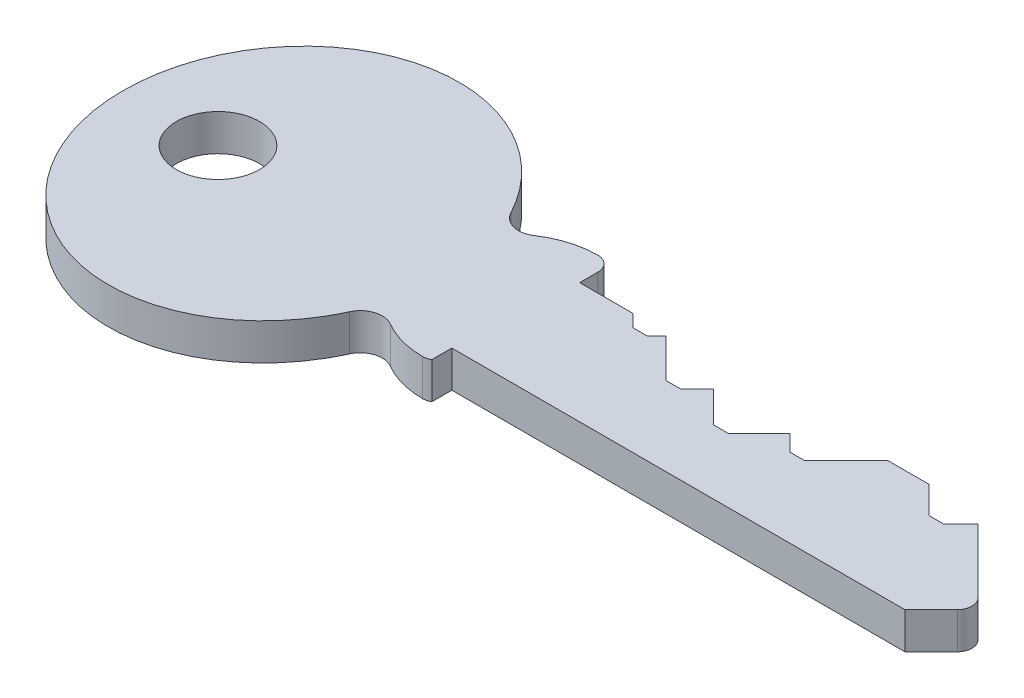
ISO-10303-21;
HEADER;
FILE_DESCRIPTION(('STEP AP214'),'2;1');
FILE_NAME('part.step','',(''),(''),'','','');
FILE_SCHEMA(('AUTOMOTIVE_DESIGN { 1 0 10303 214 1 1 1 1 }'));
ENDSEC;
DATA;
#1=APPLICATION_CONTEXT('core data for automotive mechanical design processes');
#2=APPLICATION_PROTOCOL_DEFINITION('international standard','automotive_design',2000,#1);
#3=PRODUCT_CONTEXT('',#1,'mechanical');
#4=PRODUCT('Part','Part','',(#3));
#5=PRODUCT_RELATED_PRODUCT_CATEGORY('part','',(#4));
#6=PRODUCT_DEFINITION_FORMATION('','',#4);
#7=PRODUCT_DEFINITION_CONTEXT('part definition',#1,'design');
#8=PRODUCT_DEFINITION('design','',#6,#7);
#9=PRODUCT_DEFINITION_SHAPE('','',#8);
#10=(LENGTH_UNIT() NAMED_UNIT(*) SI_UNIT(.MILLI.,.METRE.));
#11=(NAMED_UNIT(*) PLANE_ANGLE_UNIT() SI_UNIT($,.RADIAN.));
#12=(NAMED_UNIT(*) SI_UNIT($,.STERADIAN.) SOLID_ANGLE_UNIT());
#13=UNCERTAINTY_MEASURE_WITH_UNIT(LENGTH_MEASURE(1.E-05),#10,'distance_accuracy_value','');
#14=(GEOMETRIC_REPRESENTATION_CONTEXT(3) GLOBAL_UNCERTAINTY_ASSIGNED_CONTEXT((#13)) GLOBAL_UNIT_ASSIGNED_CONTEXT((#10,
#11,#12)) REPRESENTATION_CONTEXT('',''));
#15=CARTESIAN_POINT('',(0.,0.,0.));
#16=DIRECTION('',(0.,0.,1.));
#17=DIRECTION('',(1.,0.,0.));
#18=AXIS2_PLACEMENT_3D('',#15,#16,#17);
#19=CARTESIAN_POINT('',(-16.,1.25,0.));
#20=DIRECTION('',(0.,1.,0.));
#21=DIRECTION('',(0.,0.,1.));
#22=AXIS2_PLACEMENT_3D('',#19,#20,#21);
#23=PLANE('',#22);
#24=CARTESIAN_POINT('',(-20.5,1.25,0.));
#25=DIRECTION('',(0.,1.,0.));
#26=DIRECTION('',(0.,0.,1.));
#27=AXIS2_PLACEMENT_3D('',#24,#25,#26);
#28=CIRCLE('',#27,2.85);
#29=CARTESIAN_POINT('',(-20.5,1.25,2.85));
#30=VERTEX_POINT('',#29);
#31=EDGE_CURVE('E361',#30,#30,#28,.T.);
#32=ORIENTED_EDGE('',*,*,#31,.F.);
#33=EDGE_LOOP('',(#32));
#34=FACE_BOUND('',#33,.T.);
#35=DIRECTION('',(0.707106781186546,0.,-0.707106781186549));
#36=VECTOR('',#35,1.);
#37=CARTESIAN_POINT('',(30.5,1.25,4.));
#38=LINE('',#37,#36);
#39=CARTESIAN_POINT('',(30.5,1.25,4.));
#40=VERTEX_POINT('',#39);
#41=CARTESIAN_POINT('',(32.2928932188135,1.25,2.20710678118655));
#42=VERTEX_POINT('',#41);
#43=EDGE_CURVE('E369',#40,#42,#38,.T.);
#44=ORIENTED_EDGE('',*,*,#43,.T.);
#45=CARTESIAN_POINT('',(31.5857864376269,1.25,1.5));
#46=DIRECTION('',(0.,1.,0.));
#47=DIRECTION('',(0.,0.,1.));
#48=AXIS2_PLACEMENT_3D('',#45,#46,#47);
#49=CIRCLE('',#48,1.);
#50=CARTESIAN_POINT('',(32.2928932188134,1.25,0.792893218813451));
#51=VERTEX_POINT('',#50);
#52=EDGE_CURVE('E11',#42,#51,#49,.T.);
#53=ORIENTED_EDGE('',*,*,#52,.T.);
#54=DIRECTION('',(-0.707106781186549,0.,-0.707106781186546));
#55=VECTOR('',#54,1.);
#56=CARTESIAN_POINT('',(33.,1.25,1.5));
#57=LINE('',#56,#55);
#58=CARTESIAN_POINT('',(27.9249999999999,1.25,-3.57500000000005));
#59=VERTEX_POINT('',#58);
#60=EDGE_CURVE('E372',#51,#59,#57,.T.);
#61=ORIENTED_EDGE('',*,*,#60,.T.);
#62=DIRECTION('',(0.707106781186514,0.,-0.707106781186581));
#63=VECTOR('',#62,1.);
#64=CARTESIAN_POINT('',(26.75,1.25,-2.4));
#65=LINE('',#64,#63);
#66=CARTESIAN_POINT('',(26.75,1.25,-2.4));
#67=VERTEX_POINT('',#66);
#68=EDGE_CURVE('E257',#67,#59,#65,.T.);
#69=ORIENTED_EDGE('',*,*,#68,.F.);
#70=DIRECTION('',(1.,0.,0.));
#71=VECTOR('',#70,1.);
#72=CARTESIAN_POINT('',(25.75,1.25,-2.4));
#73=LINE('',#72,#71);
#74=CARTESIAN_POINT('',(25.75,1.25,-2.4));
#75=VERTEX_POINT('',#74);
#76=EDGE_CURVE('E243',#75,#67,#73,.T.);
#77=ORIENTED_EDGE('',*,*,#76,.F.);
#78=DIRECTION('',(0.707106781186581,0.,0.707106781186514));
#79=VECTOR('',#78,1.);
#80=CARTESIAN_POINT('',(22.25,1.25,-5.89999999999967));
#81=LINE('',#80,#79);
#82=CARTESIAN_POINT('',(23.8999999999998,1.25,-4.25));
#83=VERTEX_POINT('',#82);
#84=EDGE_CURVE('E233',#83,#75,#81,.T.);
#85=ORIENTED_EDGE('',*,*,#84,.F.);
#86=DIRECTION('',(-1.,0.,0.));
#87=VECTOR('',#86,1.);
#88=CARTESIAN_POINT('',(27.25,1.25,-4.25));
#89=LINE('',#88,#87);
#90=CARTESIAN_POINT('',(21.0999999999997,1.25,-4.25));
#91=VERTEX_POINT('',#90);
#92=EDGE_CURVE('E376',#83,#91,#89,.T.);
#93=ORIENTED_EDGE('',*,*,#92,.T.);
#94=DIRECTION('',(0.707106781186514,0.,-0.707106781186581));
#95=VECTOR('',#94,1.);
#96=CARTESIAN_POINT('',(18.25,1.25,-1.4));
#97=LINE('',#96,#95);
#98=CARTESIAN_POINT('',(18.25,1.25,-1.4));
#99=VERTEX_POINT('',#98);
#100=EDGE_CURVE('E272',#99,#91,#97,.T.);
#101=ORIENTED_EDGE('',*,*,#100,.F.);
#102=DIRECTION('',(1.,0.,0.));
#103=VECTOR('',#102,1.);
#104=CARTESIAN_POINT('',(17.25,1.25,-1.4));
#105=LINE('',#104,#103);
#106=CARTESIAN_POINT('',(17.25,1.25,-1.4));
#107=VERTEX_POINT('',#106);
#108=EDGE_CURVE('E269',#107,#99,#105,.T.);
#109=ORIENTED_EDGE('',*,*,#108,.F.);
#110=DIRECTION('',(0.70710678118658,0.,0.707106781186515));
#111=VECTOR('',#110,1.);
#112=CARTESIAN_POINT('',(13.75,1.25,-4.89999999999967));
#113=LINE('',#112,#111);
#114=CARTESIAN_POINT('',(16.1249999999998,1.25,-2.52500000000005));
#115=VERTEX_POINT('',#114);
#116=EDGE_CURVE('E267',#115,#107,#113,.T.);
#117=ORIENTED_EDGE('',*,*,#116,.F.);
#118=DIRECTION('',(0.707106781186514,0.,-0.707106781186581));
#119=VECTOR('',#118,1.);
#120=CARTESIAN_POINT('',(14.,1.25,-0.4));
#121=LINE('',#120,#119);
#122=CARTESIAN_POINT('',(14.,1.25,-0.4));
#123=VERTEX_POINT('',#122);
#124=EDGE_CURVE('E294',#123,#115,#121,.T.);
#125=ORIENTED_EDGE('',*,*,#124,.F.);
#126=DIRECTION('',(1.,0.,0.));
#127=VECTOR('',#126,1.);
#128=CARTESIAN_POINT('',(13.,1.25,-0.4));
#129=LINE('',#128,#127);
#130=CARTESIAN_POINT('',(13.,1.25,-0.4));
#131=VERTEX_POINT('',#130);
#132=EDGE_CURVE('E291',#131,#123,#129,.T.);
#133=ORIENTED_EDGE('',*,*,#132,.F.);
#134=DIRECTION('',(0.707106781186581,0.,0.707106781186514));
#135=VECTOR('',#134,1.);
#136=CARTESIAN_POINT('',(9.5,1.25,-3.89999999999967));
#137=LINE('',#136,#135);
#138=CARTESIAN_POINT('',(10.8749999999998,1.25,-2.52499999999995));
#139=VERTEX_POINT('',#138);
#140=EDGE_CURVE('E289',#139,#131,#137,.T.);
#141=ORIENTED_EDGE('',*,*,#140,.F.);
#142=DIRECTION('',(0.707106781186514,0.,-0.707106781186581));
#143=VECTOR('',#142,1.);
#144=CARTESIAN_POINT('',(9.75,1.25,-1.4));
#145=LINE('',#144,#143);
#146=CARTESIAN_POINT('',(9.75,1.25,-1.4));
#147=VERTEX_POINT('',#146);
#148=EDGE_CURVE('E316',#147,#139,#145,.T.);
#149=ORIENTED_EDGE('',*,*,#148,.F.);
#150=DIRECTION('',(1.,0.,0.));
#151=VECTOR('',#150,1.);
#152=CARTESIAN_POINT('',(8.75,1.25,-1.4));
#153=LINE('',#152,#151);
#154=CARTESIAN_POINT('',(8.75,1.25,-1.4));
#155=VERTEX_POINT('',#154);
#156=EDGE_CURVE('E313',#155,#147,#153,.T.);
#157=ORIENTED_EDGE('',*,*,#156,.F.);
#158=DIRECTION('',(0.707106781186581,0.,0.707106781186514));
#159=VECTOR('',#158,1.);
#160=CARTESIAN_POINT('',(5.25,1.25,-4.89999999999967));
#161=LINE('',#160,#159);
#162=CARTESIAN_POINT('',(6.12499999999985,1.25,-4.02499999999991));
#163=VERTEX_POINT('',#162);
#164=EDGE_CURVE('E311',#163,#155,#161,.T.);
#165=ORIENTED_EDGE('',*,*,#164,.F.);
#166=DIRECTION('',(0.707106781186514,0.,-0.707106781186581));
#167=VECTOR('',#166,1.);
#168=CARTESIAN_POINT('',(5.5,1.25,-3.4));
#169=LINE('',#168,#167);
#170=CARTESIAN_POINT('',(5.5,1.25,-3.4));
#171=VERTEX_POINT('',#170);
#172=EDGE_CURVE('E338',#171,#163,#169,.T.);
#173=ORIENTED_EDGE('',*,*,#172,.F.);
#174=DIRECTION('',(1.,0.,0.));
#175=VECTOR('',#174,1.);
#176=CARTESIAN_POINT('',(4.5,1.25,-3.4));
#177=LINE('',#176,#175);
#178=CARTESIAN_POINT('',(4.5,1.25,-3.4));
#179=VERTEX_POINT('',#178);
#180=EDGE_CURVE('E335',#179,#171,#177,.T.);
#181=ORIENTED_EDGE('',*,*,#180,.F.);
#182=DIRECTION('',(0.707106781186581,0.,0.707106781186514));
#183=VECTOR('',#182,1.);
#184=CARTESIAN_POINT('',(0.999999999999999,1.25,-6.89999999999967));
#185=LINE('',#184,#183);
#186=CARTESIAN_POINT('',(3.64999999999993,1.25,-4.25));
#187=VERTEX_POINT('',#186);
#188=EDGE_CURVE('E333',#187,#179,#185,.T.);
#189=ORIENTED_EDGE('',*,*,#188,.F.);
#190=CARTESIAN_POINT('',(0.,1.25,-4.25));
#191=VERTEX_POINT('',#190);
#192=EDGE_CURVE('E374',#187,#191,#89,.T.);
#193=ORIENTED_EDGE('',*,*,#192,.T.);
#194=DIRECTION('',(0.,0.,-1.));
#195=VECTOR('',#194,1.);
#196=CARTESIAN_POINT('',(0.,1.25,-4.25));
#197=LINE('',#196,#195);
#198=CARTESIAN_POINT('',(0.,1.25,-5.5));
#199=VERTEX_POINT('',#198);
#200=EDGE_CURVE('E377',#191,#199,#197,.T.);
#201=ORIENTED_EDGE('',*,*,#200,.T.);
#202=CARTESIAN_POINT('',(-0.999999999999999,1.25,-5.5));
#203=DIRECTION('',(0.,1.,0.));
#204=DIRECTION('',(0.,0.,1.));
#205=AXIS2_PLACEMENT_3D('',#202,#203,#204);
#206=CIRCLE('',#205,1.);
#207=CARTESIAN_POINT('',(-0.999999999999999,1.25,-6.5));
#208=VERTEX_POINT('',#207);
#209=EDGE_CURVE('E379',#199,#208,#206,.T.);
#210=ORIENTED_EDGE('',*,*,#209,.T.);
#211=CARTESIAN_POINT('',(-1.,1.25,-0.500000000000004));
#212=DIRECTION('',(0.,1.,0.));
#213=DIRECTION('',(0.,0.,1.));
#214=AXIS2_PLACEMENT_3D('',#211,#212,#213);
#215=CIRCLE('',#214,6.);
#216=CARTESIAN_POINT('',(-4.33307854809879,1.25,-5.48904674183392));
#217=VERTEX_POINT('',#216);
#218=EDGE_CURVE('E381',#208,#217,#215,.T.);
#219=ORIENTED_EDGE('',*,*,#218,.T.);
#220=CARTESIAN_POINT('',(-5.1663481851235,1.25,-6.73630842729241));
#221=DIRECTION('',(0.,-1.,0.));
#222=DIRECTION('',(0.,0.,-1.));
#223=AXIS2_PLACEMENT_3D('',#220,#221,#222);
#224=CIRCLE('',#223,1.50000000000001);
#225=CARTESIAN_POINT('',(-6.49012647159286,1.25,-6.03089291266839));
#226=VERTEX_POINT('',#225);
#227=EDGE_CURVE('E383',#217,#226,#224,.T.);
#228=ORIENTED_EDGE('',*,*,#227,.T.);
#229=CARTESIAN_POINT('',(-16.,1.25,0.));
#230=DIRECTION('',(0.,1.,0.));
#231=DIRECTION('',(0.,0.,1.));
#232=AXIS2_PLACEMENT_3D('',#229,#230,#231);
#233=ELLIPSE('',#232,12.,11.);
#234=CARTESIAN_POINT('',(-6.15353154316297,1.25,5.34957825301892));
#235=VERTEX_POINT('',#234);
#236=EDGE_CURVE('E385',#226,#235,#233,.T.);
#237=ORIENTED_EDGE('',*,*,#236,.T.);
#238=CARTESIAN_POINT('',(-4.78899978983436,1.25,5.97251733042371));
#239=DIRECTION('',(0.,-1.,0.));
#240=DIRECTION('',(0.,0.,1.));
#241=AXIS2_PLACEMENT_3D('',#238,#239,#240);
#242=CIRCLE('',#241,1.50000000000001);
#243=CARTESIAN_POINT('',(-4.03119983186748,1.25,4.67801386433897));
#244=VERTEX_POINT('',#243);
#245=EDGE_CURVE('E388',#235,#244,#242,.T.);
#246=ORIENTED_EDGE('',*,*,#245,.T.);
#247=CARTESIAN_POINT('',(-1.00000000000001,1.25,-0.5));
#248=DIRECTION('',(0.,1.,0.));
#249=DIRECTION('',(0.,0.,-1.));
#250=AXIS2_PLACEMENT_3D('',#247,#248,#249);
#251=CIRCLE('',#250,6.);
#252=CARTESIAN_POINT('',(-1.,1.25,5.5));
#253=VERTEX_POINT('',#252);
#254=EDGE_CURVE('E616',#244,#253,#251,.T.);
#255=ORIENTED_EDGE('',*,*,#254,.T.);
#256=CARTESIAN_POINT('',(-1.,1.25,4.5));
#257=DIRECTION('',(0.,1.,0.));
#258=DIRECTION('',(0.,0.,-1.));
#259=AXIS2_PLACEMENT_3D('',#256,#257,#258);
#260=CIRCLE('',#259,1.);
#261=CARTESIAN_POINT('',(-0.5,1.25,5.36602540378444));
#262=VERTEX_POINT('',#261);
#263=EDGE_CURVE('E473',#253,#262,#260,.T.);
#264=ORIENTED_EDGE('',*,*,#263,.T.);
#265=DIRECTION('',(0.,0.,1.));
#266=VECTOR('',#265,1.);
#267=CARTESIAN_POINT('',(-0.5,1.25,4.));
#268=LINE('',#267,#266);
#269=CARTESIAN_POINT('',(-0.5,1.25,4.));
#270=VERTEX_POINT('',#269);
#271=EDGE_CURVE('E352',#270,#262,#268,.T.);
#272=ORIENTED_EDGE('',*,*,#271,.F.);
#273=DIRECTION('',(1.,0.,0.));
#274=VECTOR('',#273,1.);
#275=CARTESIAN_POINT('',(0.,1.25,4.));
#276=LINE('',#275,#274);
#277=EDGE_CURVE('E367',#270,#40,#276,.T.);
#278=ORIENTED_EDGE('',*,*,#277,.T.);
#279=EDGE_LOOP('',(#44,#53,#61,#69,#77,#85,#93,#101,#109,#117,#125,#133,#141,#149,#157,#165,
#173,#181,#189,#193,#201,#210,#219,#228,#237,#246,#255,#264,#272,#278));
#280=FACE_BOUND('',#279,.T.);
#281=ADVANCED_FACE('F37',(#34,#280),#23,.T.);
#282=CARTESIAN_POINT('',(-16.,-1.25,0.));
#283=DIRECTION('',(0.,1.,0.));
#284=DIRECTION('',(0.,0.,1.));
#285=AXIS2_PLACEMENT_3D('',#282,#283,#284);
#286=PLANE('',#285);
#287=CARTESIAN_POINT('',(-20.5,-1.25,0.));
#288=DIRECTION('',(0.,1.,0.));
#289=DIRECTION('',(0.,0.,1.));
#290=AXIS2_PLACEMENT_3D('',#287,#288,#289);
#291=CIRCLE('',#290,2.85);
#292=CARTESIAN_POINT('',(-20.5,-1.25,2.85));
#293=VERTEX_POINT('',#292);
#294=EDGE_CURVE('E360',#293,#293,#291,.T.);
#295=ORIENTED_EDGE('',*,*,#294,.T.);
#296=EDGE_LOOP('',(#295));
#297=FACE_BOUND('',#296,.T.);
#298=DIRECTION('',(-0.707106781186549,0.,-0.707106781186546));
#299=VECTOR('',#298,1.);
#300=CARTESIAN_POINT('',(33.,-1.25,1.5));
#301=LINE('',#300,#299);
#302=CARTESIAN_POINT('',(32.2928932188134,-1.25,0.792893218813451));
#303=VERTEX_POINT('',#302);
#304=CARTESIAN_POINT('',(27.9249999999999,-1.25,-3.57500000000005));
#305=VERTEX_POINT('',#304);
#306=EDGE_CURVE('E518',#303,#305,#301,.T.);
#307=ORIENTED_EDGE('',*,*,#306,.F.);
#308=CARTESIAN_POINT('',(31.5857864376269,-1.25,1.5));
#309=DIRECTION('',(0.,1.,0.));
#310=DIRECTION('',(0.,0.,1.));
#311=AXIS2_PLACEMENT_3D('',#308,#309,#310);
#312=CIRCLE('',#311,1.);
#313=CARTESIAN_POINT('',(32.2928932188135,-1.25,2.20710678118655));
#314=VERTEX_POINT('',#313);
#315=EDGE_CURVE('E59',#303,#314,#312,.F.);
#316=ORIENTED_EDGE('',*,*,#315,.T.);
#317=DIRECTION('',(0.707106781186546,0.,-0.707106781186549));
#318=VECTOR('',#317,1.);
#319=CARTESIAN_POINT('',(30.5,-1.25,4.));
#320=LINE('',#319,#318);
#321=CARTESIAN_POINT('',(30.5,-1.25,4.));
#322=VERTEX_POINT('',#321);
#323=EDGE_CURVE('E523',#322,#314,#320,.T.);
#324=ORIENTED_EDGE('',*,*,#323,.F.);
#325=DIRECTION('',(1.,0.,0.));
#326=VECTOR('',#325,1.);
#327=CARTESIAN_POINT('',(0.,-1.25,4.));
#328=LINE('',#327,#326);
#329=CARTESIAN_POINT('',(-0.5,-1.25,4.));
#330=VERTEX_POINT('',#329);
#331=EDGE_CURVE('E364',#330,#322,#328,.T.);
#332=ORIENTED_EDGE('',*,*,#331,.F.);
#333=DIRECTION('',(0.,0.,1.));
#334=VECTOR('',#333,1.);
#335=CARTESIAN_POINT('',(-0.5,-1.25,0.));
#336=LINE('',#335,#334);
#337=CARTESIAN_POINT('',(-0.5,-1.25,5.36602540378444));
#338=VERTEX_POINT('',#337);
#339=EDGE_CURVE('E357',#330,#338,#336,.T.);
#340=ORIENTED_EDGE('',*,*,#339,.T.);
#341=CARTESIAN_POINT('',(-1.,-1.25,4.5));
#342=DIRECTION('',(0.,1.,0.));
#343=DIRECTION('',(0.,0.,-1.));
#344=AXIS2_PLACEMENT_3D('',#341,#342,#343);
#345=CIRCLE('',#344,1.);
#346=CARTESIAN_POINT('',(-1.,-1.25,5.5));
#347=VERTEX_POINT('',#346);
#348=EDGE_CURVE('E370',#347,#338,#345,.T.);
#349=ORIENTED_EDGE('',*,*,#348,.F.);
#350=CARTESIAN_POINT('',(-1.00000000000001,-1.25,-0.5));
#351=DIRECTION('',(0.,1.,0.));
#352=DIRECTION('',(0.,0.,-1.));
#353=AXIS2_PLACEMENT_3D('',#350,#351,#352);
#354=CIRCLE('',#353,6.);
#355=CARTESIAN_POINT('',(-4.03119983186748,-1.25,4.67801386433897));
#356=VERTEX_POINT('',#355);
#357=EDGE_CURVE('E459',#356,#347,#354,.T.);
#358=ORIENTED_EDGE('',*,*,#357,.F.);
#359=CARTESIAN_POINT('',(-4.78899978983436,-1.25,5.97251733042371));
#360=DIRECTION('',(0.,-1.,0.));
#361=DIRECTION('',(0.,0.,1.));
#362=AXIS2_PLACEMENT_3D('',#359,#360,#361);
#363=CIRCLE('',#362,1.50000000000001);
#364=CARTESIAN_POINT('',(-6.15353154316297,-1.25,5.34957825301892));
#365=VERTEX_POINT('',#364);
#366=EDGE_CURVE('E468',#365,#356,#363,.T.);
#367=ORIENTED_EDGE('',*,*,#366,.F.);
#368=CARTESIAN_POINT('',(-16.,-1.25,0.));
#369=DIRECTION('',(0.,1.,0.));
#370=DIRECTION('',(0.,0.,1.));
#371=AXIS2_PLACEMENT_3D('',#368,#369,#370);
#372=ELLIPSE('',#371,12.,11.);
#373=CARTESIAN_POINT('',(-6.49012647159286,-1.25,-6.03089291266839));
#374=VERTEX_POINT('',#373);
#375=EDGE_CURVE('E538',#374,#365,#372,.T.);
#376=ORIENTED_EDGE('',*,*,#375,.F.);
#377=CARTESIAN_POINT('',(-5.1663481851235,-1.25,-6.73630842729241));
#378=DIRECTION('',(0.,-1.,0.));
#379=DIRECTION('',(0.,0.,-1.));
#380=AXIS2_PLACEMENT_3D('',#377,#378,#379);
#381=CIRCLE('',#380,1.50000000000001);
#382=CARTESIAN_POINT('',(-4.33307854809879,-1.25,-5.48904674183392));
#383=VERTEX_POINT('',#382);
#384=EDGE_CURVE('E536',#383,#374,#381,.T.);
#385=ORIENTED_EDGE('',*,*,#384,.F.);
#386=CARTESIAN_POINT('',(-1.,-1.25,-0.500000000000004));
#387=DIRECTION('',(0.,1.,0.));
#388=DIRECTION('',(0.,0.,1.));
#389=AXIS2_PLACEMENT_3D('',#386,#387,#388);
#390=CIRCLE('',#389,6.);
#391=CARTESIAN_POINT('',(-0.999999999999999,-1.25,-6.5));
#392=VERTEX_POINT('',#391);
#393=EDGE_CURVE('E534',#392,#383,#390,.T.);
#394=ORIENTED_EDGE('',*,*,#393,.F.);
#395=CARTESIAN_POINT('',(-0.999999999999999,-1.25,-5.5));
#396=DIRECTION('',(0.,1.,0.));
#397=DIRECTION('',(0.,0.,1.));
#398=AXIS2_PLACEMENT_3D('',#395,#396,#397);
#399=CIRCLE('',#398,1.);
#400=CARTESIAN_POINT('',(0.,-1.25,-5.5));
#401=VERTEX_POINT('',#400);
#402=EDGE_CURVE('E532',#401,#392,#399,.T.);
#403=ORIENTED_EDGE('',*,*,#402,.F.);
#404=DIRECTION('',(0.,0.,-1.));
#405=VECTOR('',#404,1.);
#406=CARTESIAN_POINT('',(0.,-1.25,-4.25));
#407=LINE('',#406,#405);
#408=CARTESIAN_POINT('',(0.,-1.25,-4.25));
#409=VERTEX_POINT('',#408);
#410=EDGE_CURVE('E530',#409,#401,#407,.T.);
#411=ORIENTED_EDGE('',*,*,#410,.F.);
#412=DIRECTION('',(-1.,0.,0.));
#413=VECTOR('',#412,1.);
#414=CARTESIAN_POINT('',(27.25,-1.25,-4.25));
#415=LINE('',#414,#413);
#416=CARTESIAN_POINT('',(3.64999999999993,-1.25,-4.25));
#417=VERTEX_POINT('',#416);
#418=EDGE_CURVE('E522',#417,#409,#415,.T.);
#419=ORIENTED_EDGE('',*,*,#418,.F.);
#420=DIRECTION('',(0.707106781186581,0.,0.707106781186514));
#421=VECTOR('',#420,1.);
#422=CARTESIAN_POINT('',(0.999999999999999,-1.25,-6.89999999999967));
#423=LINE('',#422,#421);
#424=CARTESIAN_POINT('',(4.5,-1.25,-3.4));
#425=VERTEX_POINT('',#424);
#426=EDGE_CURVE('E332',#417,#425,#423,.T.);
#427=ORIENTED_EDGE('',*,*,#426,.T.);
#428=DIRECTION('',(1.,0.,0.));
#429=VECTOR('',#428,1.);
#430=CARTESIAN_POINT('',(4.5,-1.25,-3.4));
#431=LINE('',#430,#429);
#432=CARTESIAN_POINT('',(5.5,-1.25,-3.4));
#433=VERTEX_POINT('',#432);
#434=EDGE_CURVE('E344',#425,#433,#431,.T.);
#435=ORIENTED_EDGE('',*,*,#434,.T.);
#436=DIRECTION('',(0.707106781186514,0.,-0.707106781186581));
#437=VECTOR('',#436,1.);
#438=CARTESIAN_POINT('',(5.5,-1.25,-3.4));
#439=LINE('',#438,#437);
#440=CARTESIAN_POINT('',(6.12499999999985,-1.25,-4.02499999999991));
#441=VERTEX_POINT('',#440);
#442=EDGE_CURVE('E336',#433,#441,#439,.T.);
#443=ORIENTED_EDGE('',*,*,#442,.T.);
#444=DIRECTION('',(0.707106781186581,0.,0.707106781186514));
#445=VECTOR('',#444,1.);
#446=CARTESIAN_POINT('',(5.25,-1.25,-4.89999999999967));
#447=LINE('',#446,#445);
#448=CARTESIAN_POINT('',(8.75,-1.25,-1.4));
#449=VERTEX_POINT('',#448);
#450=EDGE_CURVE('E310',#441,#449,#447,.T.);
#451=ORIENTED_EDGE('',*,*,#450,.T.);
#452=DIRECTION('',(1.,0.,0.));
#453=VECTOR('',#452,1.);
#454=CARTESIAN_POINT('',(8.75,-1.25,-1.4));
#455=LINE('',#454,#453);
#456=CARTESIAN_POINT('',(9.75,-1.25,-1.4));
#457=VERTEX_POINT('',#456);
#458=EDGE_CURVE('E322',#449,#457,#455,.T.);
#459=ORIENTED_EDGE('',*,*,#458,.T.);
#460=DIRECTION('',(0.707106781186514,0.,-0.707106781186581));
#461=VECTOR('',#460,1.);
#462=CARTESIAN_POINT('',(9.75,-1.25,-1.4));
#463=LINE('',#462,#461);
#464=CARTESIAN_POINT('',(10.8749999999998,-1.25,-2.52499999999995));
#465=VERTEX_POINT('',#464);
#466=EDGE_CURVE('E314',#457,#465,#463,.T.);
#467=ORIENTED_EDGE('',*,*,#466,.T.);
#468=DIRECTION('',(0.707106781186581,0.,0.707106781186514));
#469=VECTOR('',#468,1.);
#470=CARTESIAN_POINT('',(9.5,-1.25,-3.89999999999967));
#471=LINE('',#470,#469);
#472=CARTESIAN_POINT('',(13.,-1.25,-0.4));
#473=VERTEX_POINT('',#472);
#474=EDGE_CURVE('E288',#465,#473,#471,.T.);
#475=ORIENTED_EDGE('',*,*,#474,.T.);
#476=DIRECTION('',(1.,0.,0.));
#477=VECTOR('',#476,1.);
#478=CARTESIAN_POINT('',(13.,-1.25,-0.4));
#479=LINE('',#478,#477);
#480=CARTESIAN_POINT('',(14.,-1.25,-0.4));
#481=VERTEX_POINT('',#480);
#482=EDGE_CURVE('E300',#473,#481,#479,.T.);
#483=ORIENTED_EDGE('',*,*,#482,.T.);
#484=DIRECTION('',(0.707106781186514,0.,-0.707106781186581));
#485=VECTOR('',#484,1.);
#486=CARTESIAN_POINT('',(14.,-1.25,-0.4));
#487=LINE('',#486,#485);
#488=CARTESIAN_POINT('',(16.1249999999998,-1.25,-2.52500000000005));
#489=VERTEX_POINT('',#488);
#490=EDGE_CURVE('E292',#481,#489,#487,.T.);
#491=ORIENTED_EDGE('',*,*,#490,.T.);
#492=DIRECTION('',(0.70710678118658,0.,0.707106781186515));
#493=VECTOR('',#492,1.);
#494=CARTESIAN_POINT('',(13.75,-1.25,-4.89999999999967));
#495=LINE('',#494,#493);
#496=CARTESIAN_POINT('',(17.25,-1.25,-1.4));
#497=VERTEX_POINT('',#496);
#498=EDGE_CURVE('E252',#489,#497,#495,.T.);
#499=ORIENTED_EDGE('',*,*,#498,.T.);
#500=DIRECTION('',(1.,0.,0.));
#501=VECTOR('',#500,1.);
#502=CARTESIAN_POINT('',(17.25,-1.25,-1.4));
#503=LINE('',#502,#501);
#504=CARTESIAN_POINT('',(18.25,-1.25,-1.4));
#505=VERTEX_POINT('',#504);
#506=EDGE_CURVE('E278',#497,#505,#503,.T.);
#507=ORIENTED_EDGE('',*,*,#506,.T.);
#508=DIRECTION('',(0.707106781186514,0.,-0.707106781186581));
#509=VECTOR('',#508,1.);
#510=CARTESIAN_POINT('',(18.25,-1.25,-1.4));
#511=LINE('',#510,#509);
#512=CARTESIAN_POINT('',(21.0999999999997,-1.25,-4.25));
#513=VERTEX_POINT('',#512);
#514=EDGE_CURVE('E270',#505,#513,#511,.T.);
#515=ORIENTED_EDGE('',*,*,#514,.T.);
#516=CARTESIAN_POINT('',(23.8999999999998,-1.25,-4.25));
#517=VERTEX_POINT('',#516);
#518=EDGE_CURVE('E525',#517,#513,#415,.T.);
#519=ORIENTED_EDGE('',*,*,#518,.F.);
#520=DIRECTION('',(0.707106781186581,0.,0.707106781186514));
#521=VECTOR('',#520,1.);
#522=CARTESIAN_POINT('',(22.25,-1.25,-5.89999999999967));
#523=LINE('',#522,#521);
#524=CARTESIAN_POINT('',(25.75,-1.25,-2.4));
#525=VERTEX_POINT('',#524);
#526=EDGE_CURVE('E261',#517,#525,#523,.T.);
#527=ORIENTED_EDGE('',*,*,#526,.T.);
#528=DIRECTION('',(1.,0.,0.));
#529=VECTOR('',#528,1.);
#530=CARTESIAN_POINT('',(25.75,-1.25,-2.4));
#531=LINE('',#530,#529);
#532=CARTESIAN_POINT('',(26.75,-1.25,-2.4));
#533=VERTEX_POINT('',#532);
#534=EDGE_CURVE('E250',#525,#533,#531,.T.);
#535=ORIENTED_EDGE('',*,*,#534,.T.);
#536=DIRECTION('',(0.707106781186514,0.,-0.707106781186581));
#537=VECTOR('',#536,1.);
#538=CARTESIAN_POINT('',(26.75,-1.25,-2.4));
#539=LINE('',#538,#537);
#540=EDGE_CURVE('E244',#533,#305,#539,.T.);
#541=ORIENTED_EDGE('',*,*,#540,.T.);
#542=EDGE_LOOP('',(#307,#316,#324,#332,#340,#349,#358,#367,#376,#385,#394,#403,#411,#419,#427,
#435,#443,#451,#459,#467,#475,#483,#491,#499,#507,#515,#519,#527,#535,#541));
#543=FACE_BOUND('',#542,.T.);
#544=ADVANCED_FACE('F423',(#297,#543),#286,.F.);
#545=CARTESIAN_POINT('',(33.,1.25,1.5));
#546=DIRECTION('',(-0.707106781186546,0.,0.707106781186549));
#547=DIRECTION('',(0.707106781186549,0.,0.707106781186546));
#548=AXIS2_PLACEMENT_3D('',#545,#546,#547);
#549=PLANE('',#548);
#550=ORIENTED_EDGE('',*,*,#60,.F.);
#551=DIRECTION('',(0.,-1.,0.));
#552=VECTOR('',#551,1.);
#553=CARTESIAN_POINT('',(32.2928932188134,1.25,0.792893218813452));
#554=LINE('',#553,#552);
#555=EDGE_CURVE('E512',#51,#303,#554,.T.);
#556=ORIENTED_EDGE('',*,*,#555,.T.);
#557=ORIENTED_EDGE('',*,*,#306,.T.);
#558=DIRECTION('',(0.,-1.,0.));
#559=VECTOR('',#558,1.);
#560=CARTESIAN_POINT('',(27.9249999999999,1.25,-3.57500000000005));
#561=LINE('',#560,#559);
#562=EDGE_CURVE('E509',#59,#305,#561,.T.);
#563=ORIENTED_EDGE('',*,*,#562,.F.);
#564=EDGE_LOOP('',(#550,#556,#557,#563));
#565=FACE_BOUND('',#564,.T.);
#566=ADVANCED_FACE('F419',(#565),#549,.F.);
#567=CARTESIAN_POINT('',(27.25,1.25,-4.25));
#568=DIRECTION('',(0.,0.,1.));
#569=DIRECTION('',(1.,0.,0.));
#570=AXIS2_PLACEMENT_3D('',#567,#568,#569);
#571=PLANE('',#570);
#572=DIRECTION('',(0.,1.,0.));
#573=VECTOR('',#572,1.);
#574=CARTESIAN_POINT('',(3.64999999999992,1.25,-4.25));
#575=LINE('',#574,#573);
#576=EDGE_CURVE('E507',#417,#187,#575,.T.);
#577=ORIENTED_EDGE('',*,*,#576,.F.);
#578=ORIENTED_EDGE('',*,*,#418,.T.);
#579=DIRECTION('',(0.,-1.,0.));
#580=VECTOR('',#579,1.);
#581=CARTESIAN_POINT('',(0.,1.25,-4.25));
#582=LINE('',#581,#580);
#583=EDGE_CURVE('E495',#191,#409,#582,.T.);
#584=ORIENTED_EDGE('',*,*,#583,.F.);
#585=ORIENTED_EDGE('',*,*,#192,.F.);
#586=EDGE_LOOP('',(#577,#578,#584,#585));
#587=FACE_BOUND('',#586,.T.);
#588=ADVANCED_FACE('F415',(#587),#571,.F.);
#589=ORIENTED_EDGE('',*,*,#518,.T.);
#590=DIRECTION('',(0.,-1.,0.));
#591=VECTOR('',#590,1.);
#592=CARTESIAN_POINT('',(21.0999999999997,1.25,-4.25));
#593=LINE('',#592,#591);
#594=EDGE_CURVE('E504',#91,#513,#593,.T.);
#595=ORIENTED_EDGE('',*,*,#594,.F.);
#596=ORIENTED_EDGE('',*,*,#92,.F.);
#597=DIRECTION('',(0.,1.,0.));
#598=VECTOR('',#597,1.);
#599=CARTESIAN_POINT('',(23.8999999999998,1.25,-4.25));
#600=LINE('',#599,#598);
#601=EDGE_CURVE('E239',#517,#83,#600,.T.);
#602=ORIENTED_EDGE('',*,*,#601,.F.);
#603=EDGE_LOOP('',(#589,#595,#596,#602));
#604=FACE_BOUND('',#603,.T.);
#605=ADVANCED_FACE('F418',(#604),#571,.F.);
#606=CARTESIAN_POINT('',(0.,1.25,4.));
#607=DIRECTION('',(0.,0.,-1.));
#608=DIRECTION('',(-1.,0.,0.));
#609=AXIS2_PLACEMENT_3D('',#606,#607,#608);
#610=PLANE('',#609);
#611=ORIENTED_EDGE('',*,*,#331,.T.);
#612=DIRECTION('',(0.,-1.,0.));
#613=VECTOR('',#612,1.);
#614=CARTESIAN_POINT('',(30.5,1.25,4.));
#615=LINE('',#614,#613);
#616=EDGE_CURVE('E498',#40,#322,#615,.T.);
#617=ORIENTED_EDGE('',*,*,#616,.F.);
#618=ORIENTED_EDGE('',*,*,#277,.F.);
#619=DIRECTION('',(0.,1.,0.));
#620=VECTOR('',#619,1.);
#621=CARTESIAN_POINT('',(-0.5,-8.75,4.));
#622=LINE('',#621,#620);
#623=EDGE_CURVE('E354',#330,#270,#622,.T.);
#624=ORIENTED_EDGE('',*,*,#623,.F.);
#625=EDGE_LOOP('',(#611,#617,#618,#624));
#626=FACE_BOUND('',#625,.T.);
#627=ADVANCED_FACE('F426',(#626),#610,.F.);
#628=CARTESIAN_POINT('',(30.5,1.25,4.));
#629=DIRECTION('',(-0.707106781186549,0.,-0.707106781186546));
#630=DIRECTION('',(-0.707106781186546,0.,0.707106781186549));
#631=AXIS2_PLACEMENT_3D('',#628,#629,#630);
#632=PLANE('',#631);
#633=ORIENTED_EDGE('',*,*,#323,.T.);
#634=DIRECTION('',(0.,-1.,0.));
#635=VECTOR('',#634,1.);
#636=CARTESIAN_POINT('',(32.2928932188135,1.25,2.20710678118655));
#637=LINE('',#636,#635);
#638=EDGE_CURVE('E45',#314,#42,#637,.F.);
#639=ORIENTED_EDGE('',*,*,#638,.T.);
#640=ORIENTED_EDGE('',*,*,#43,.F.);
#641=ORIENTED_EDGE('',*,*,#616,.T.);
#642=EDGE_LOOP('',(#633,#639,#640,#641));
#643=FACE_BOUND('',#642,.T.);
#644=ADVANCED_FACE('F413',(#643),#632,.F.);
#645=CARTESIAN_POINT('',(0.,1.25,-4.25));
#646=DIRECTION('',(-1.,0.,0.));
#647=DIRECTION('',(0.,0.,1.));
#648=AXIS2_PLACEMENT_3D('',#645,#646,#647);
#649=PLANE('',#648);
#650=ORIENTED_EDGE('',*,*,#410,.T.);
#651=DIRECTION('',(0.,-1.,0.));
#652=VECTOR('',#651,1.);
#653=CARTESIAN_POINT('',(0.,1.25,-5.5));
#654=LINE('',#653,#652);
#655=EDGE_CURVE('E492',#199,#401,#654,.T.);
#656=ORIENTED_EDGE('',*,*,#655,.F.);
#657=ORIENTED_EDGE('',*,*,#200,.F.);
#658=ORIENTED_EDGE('',*,*,#583,.T.);
#659=EDGE_LOOP('',(#650,#656,#657,#658));
#660=FACE_BOUND('',#659,.T.);
#661=ADVANCED_FACE('F409',(#660),#649,.F.);
#662=CARTESIAN_POINT('',(-0.999999999999999,1.25,-5.5));
#663=DIRECTION('',(0.,-1.,0.));
#664=DIRECTION('',(0.,0.,-1.));
#665=AXIS2_PLACEMENT_3D('',#662,#663,#664);
#666=CYLINDRICAL_SURFACE('',#665,1.);
#667=ORIENTED_EDGE('',*,*,#402,.T.);
#668=DIRECTION('',(0.,-1.,0.));
#669=VECTOR('',#668,1.);
#670=CARTESIAN_POINT('',(-0.999999999999999,1.25,-6.5));
#671=LINE('',#670,#669);
#672=EDGE_CURVE('E489',#208,#392,#671,.T.);
#673=ORIENTED_EDGE('',*,*,#672,.F.);
#674=ORIENTED_EDGE('',*,*,#209,.F.);
#675=ORIENTED_EDGE('',*,*,#655,.T.);
#676=EDGE_LOOP('',(#667,#673,#674,#675));
#677=FACE_BOUND('',#676,.T.);
#678=ADVANCED_FACE('F405',(#677),#666,.T.);
#679=CARTESIAN_POINT('',(-1.,1.25,-0.500000000000004));
#680=DIRECTION('',(0.,-1.,0.));
#681=DIRECTION('',(0.,0.,-1.));
#682=AXIS2_PLACEMENT_3D('',#679,#680,#681);
#683=CYLINDRICAL_SURFACE('',#682,6.);
#684=ORIENTED_EDGE('',*,*,#393,.T.);
#685=DIRECTION('',(0.,-1.,0.));
#686=VECTOR('',#685,1.);
#687=CARTESIAN_POINT('',(-4.33307854809879,1.25,-5.48904674183392));
#688=LINE('',#687,#686);
#689=EDGE_CURVE('E486',#217,#383,#688,.T.);
#690=ORIENTED_EDGE('',*,*,#689,.F.);
#691=ORIENTED_EDGE('',*,*,#218,.F.);
#692=ORIENTED_EDGE('',*,*,#672,.T.);
#693=EDGE_LOOP('',(#684,#690,#691,#692));
#694=FACE_BOUND('',#693,.T.);
#695=ADVANCED_FACE('F401',(#694),#683,.T.);
#696=CARTESIAN_POINT('',(-5.1663481851235,1.25,-6.73630842729241));
#697=DIRECTION('',(0.,-1.,0.));
#698=DIRECTION('',(0.,0.,-1.));
#699=AXIS2_PLACEMENT_3D('',#696,#697,#698);
#700=CYLINDRICAL_SURFACE('',#699,1.50000000000001);
#701=ORIENTED_EDGE('',*,*,#384,.T.);
#702=DIRECTION('',(0.,-1.,0.));
#703=VECTOR('',#702,1.);
#704=CARTESIAN_POINT('',(-6.49012647159286,1.25,-6.03089291266839));
#705=LINE('',#704,#703);
#706=EDGE_CURVE('E483',#226,#374,#705,.T.);
#707=ORIENTED_EDGE('',*,*,#706,.F.);
#708=ORIENTED_EDGE('',*,*,#227,.F.);
#709=ORIENTED_EDGE('',*,*,#689,.T.);
#710=EDGE_LOOP('',(#701,#707,#708,#709));
#711=FACE_BOUND('',#710,.T.);
#712=ADVANCED_FACE('F396',(#711),#700,.F.);
#713=DIRECTION('',(0.,-1.,0.));
#714=VECTOR('',#713,1.);
#715=SURFACE_OF_LINEAR_EXTRUSION('',#233,#714);
#716=ORIENTED_EDGE('',*,*,#375,.T.);
#717=DIRECTION('',(0.,-1.,0.));
#718=VECTOR('',#717,1.);
#719=CARTESIAN_POINT('',(-6.15353154316297,1.25,5.34957825301892));
#720=LINE('',#719,#718);
#721=EDGE_CURVE('E480',#235,#365,#720,.T.);
#722=ORIENTED_EDGE('',*,*,#721,.F.);
#723=ORIENTED_EDGE('',*,*,#236,.F.);
#724=ORIENTED_EDGE('',*,*,#706,.T.);
#725=EDGE_LOOP('',(#716,#722,#723,#724));
#726=FACE_BOUND('',#725,.T.);
#727=ADVANCED_FACE('F391',(#726),#715,.F.);
#728=CARTESIAN_POINT('',(-4.78899978983436,1.25,5.97251733042371));
#729=DIRECTION('',(0.,-1.,0.));
#730=DIRECTION('',(0.,0.,-1.));
#731=AXIS2_PLACEMENT_3D('',#728,#729,#730);
#732=CYLINDRICAL_SURFACE('',#731,1.50000000000001);
#733=ORIENTED_EDGE('',*,*,#366,.T.);
#734=DIRECTION('',(0.,-1.,0.));
#735=VECTOR('',#734,1.);
#736=CARTESIAN_POINT('',(-4.03119983186748,1.25,4.67801386433897));
#737=LINE('',#736,#735);
#738=EDGE_CURVE('E465',#244,#356,#737,.T.);
#739=ORIENTED_EDGE('',*,*,#738,.F.);
#740=ORIENTED_EDGE('',*,*,#245,.F.);
#741=ORIENTED_EDGE('',*,*,#721,.T.);
#742=EDGE_LOOP('',(#733,#739,#740,#741));
#743=FACE_BOUND('',#742,.T.);
#744=ADVANCED_FACE('F395',(#743),#732,.F.);
#745=CARTESIAN_POINT('',(-1.00000000000001,1.25,-0.5));
#746=DIRECTION('',(0.,-1.,0.));
#747=DIRECTION('',(0.,0.,-1.));
#748=AXIS2_PLACEMENT_3D('',#745,#746,#747);
#749=CYLINDRICAL_SURFACE('',#748,6.);
#750=ORIENTED_EDGE('',*,*,#357,.T.);
#751=DIRECTION('',(0.,-1.,0.));
#752=VECTOR('',#751,1.);
#753=CARTESIAN_POINT('',(-1.,1.25,5.5));
#754=LINE('',#753,#752);
#755=EDGE_CURVE('E462',#253,#347,#754,.T.);
#756=ORIENTED_EDGE('',*,*,#755,.F.);
#757=ORIENTED_EDGE('',*,*,#254,.F.);
#758=ORIENTED_EDGE('',*,*,#738,.T.);
#759=EDGE_LOOP('',(#750,#756,#757,#758));
#760=FACE_BOUND('',#759,.T.);
#761=ADVANCED_FACE('F448',(#760),#749,.T.);
#762=CARTESIAN_POINT('',(-1.,1.25,4.5));
#763=DIRECTION('',(0.,-1.,0.));
#764=DIRECTION('',(0.,0.,-1.));
#765=AXIS2_PLACEMENT_3D('',#762,#763,#764);
#766=CYLINDRICAL_SURFACE('',#765,1.);
#767=ORIENTED_EDGE('',*,*,#348,.T.);
#768=DIRECTION('',(0.,-1.,0.));
#769=VECTOR('',#768,1.);
#770=CARTESIAN_POINT('',(-0.5,1.25,5.36602540378444));
#771=LINE('',#770,#769);
#772=EDGE_CURVE('E501',#338,#262,#771,.F.);
#773=ORIENTED_EDGE('',*,*,#772,.T.);
#774=ORIENTED_EDGE('',*,*,#263,.F.);
#775=ORIENTED_EDGE('',*,*,#755,.T.);
#776=EDGE_LOOP('',(#767,#773,#774,#775));
#777=FACE_BOUND('',#776,.T.);
#778=ADVANCED_FACE('F446',(#777),#766,.T.);
#779=CARTESIAN_POINT('',(-20.5,1.25,0.));
#780=DIRECTION('',(0.,-1.,0.));
#781=DIRECTION('',(0.,0.,-1.));
#782=AXIS2_PLACEMENT_3D('',#779,#780,#781);
#783=CYLINDRICAL_SURFACE('',#782,2.85);
#784=ORIENTED_EDGE('',*,*,#31,.T.);
#785=EDGE_LOOP('',(#784));
#786=FACE_BOUND('',#785,.T.);
#787=ORIENTED_EDGE('',*,*,#294,.F.);
#788=EDGE_LOOP('',(#787));
#789=FACE_BOUND('',#788,.T.);
#790=ADVANCED_FACE('F443',(#786,#789),#783,.F.);
#791=CARTESIAN_POINT('',(-0.5,-8.75,4.));
#792=DIRECTION('',(-1.,0.,0.));
#793=DIRECTION('',(0.,0.,1.));
#794=AXIS2_PLACEMENT_3D('',#791,#792,#793);
#795=PLANE('',#794);
#796=ORIENTED_EDGE('',*,*,#623,.T.);
#797=ORIENTED_EDGE('',*,*,#271,.T.);
#798=ORIENTED_EDGE('',*,*,#772,.F.);
#799=ORIENTED_EDGE('',*,*,#339,.F.);
#800=EDGE_LOOP('',(#796,#797,#798,#799));
#801=FACE_BOUND('',#800,.T.);
#802=ADVANCED_FACE('F650',(#801),#795,.F.);
#803=CARTESIAN_POINT('',(22.25,1.25,-5.89999999999967));
#804=DIRECTION('',(0.707106781186514,0.,-0.707106781186581));
#805=DIRECTION('',(-0.707106781186581,0.,-0.707106781186514));
#806=AXIS2_PLACEMENT_3D('',#803,#804,#805);
#807=PLANE('',#806);
#808=ORIENTED_EDGE('',*,*,#601,.T.);
#809=ORIENTED_EDGE('',*,*,#84,.T.);
#810=DIRECTION('',(0.,-1.,0.));
#811=VECTOR('',#810,1.);
#812=CARTESIAN_POINT('',(25.75,1.25,-2.4));
#813=LINE('',#812,#811);
#814=EDGE_CURVE('E236',#75,#525,#813,.T.);
#815=ORIENTED_EDGE('',*,*,#814,.T.);
#816=ORIENTED_EDGE('',*,*,#526,.F.);
#817=EDGE_LOOP('',(#808,#809,#815,#816));
#818=FACE_BOUND('',#817,.T.);
#819=ADVANCED_FACE('F235',(#818),#807,.T.);
#820=CARTESIAN_POINT('',(26.75,1.25,-2.4));
#821=DIRECTION('',(-0.707106781186581,0.,-0.707106781186514));
#822=DIRECTION('',(-0.707106781186514,0.,0.707106781186581));
#823=AXIS2_PLACEMENT_3D('',#820,#821,#822);
#824=PLANE('',#823);
#825=ORIENTED_EDGE('',*,*,#562,.T.);
#826=ORIENTED_EDGE('',*,*,#540,.F.);
#827=DIRECTION('',(0.,-1.,0.));
#828=VECTOR('',#827,1.);
#829=CARTESIAN_POINT('',(26.75,1.25,-2.4));
#830=LINE('',#829,#828);
#831=EDGE_CURVE('E253',#67,#533,#830,.T.);
#832=ORIENTED_EDGE('',*,*,#831,.F.);
#833=ORIENTED_EDGE('',*,*,#68,.T.);
#834=EDGE_LOOP('',(#825,#826,#832,#833));
#835=FACE_BOUND('',#834,.T.);
#836=ADVANCED_FACE('F657',(#835),#824,.T.);
#837=CARTESIAN_POINT('',(25.75,1.25,-2.4));
#838=DIRECTION('',(0.,0.,-1.));
#839=DIRECTION('',(-1.,0.,0.));
#840=AXIS2_PLACEMENT_3D('',#837,#838,#839);
#841=PLANE('',#840);
#842=ORIENTED_EDGE('',*,*,#534,.F.);
#843=ORIENTED_EDGE('',*,*,#814,.F.);
#844=ORIENTED_EDGE('',*,*,#76,.T.);
#845=ORIENTED_EDGE('',*,*,#831,.T.);
#846=EDGE_LOOP('',(#842,#843,#844,#845));
#847=FACE_BOUND('',#846,.T.);
#848=ADVANCED_FACE('F247',(#847),#841,.T.);
#849=CARTESIAN_POINT('',(0.999999999999999,1.25,-6.89999999999967));
#850=DIRECTION('',(0.707106781186514,0.,-0.707106781186581));
#851=DIRECTION('',(-0.707106781186581,0.,-0.707106781186514));
#852=AXIS2_PLACEMENT_3D('',#849,#850,#851);
#853=PLANE('',#852);
#854=ORIENTED_EDGE('',*,*,#576,.T.);
#855=ORIENTED_EDGE('',*,*,#188,.T.);
#856=DIRECTION('',(0.,-1.,0.));
#857=VECTOR('',#856,1.);
#858=CARTESIAN_POINT('',(4.5,1.25,-3.4));
#859=LINE('',#858,#857);
#860=EDGE_CURVE('E350',#179,#425,#859,.T.);
#861=ORIENTED_EDGE('',*,*,#860,.T.);
#862=ORIENTED_EDGE('',*,*,#426,.F.);
#863=EDGE_LOOP('',(#854,#855,#861,#862));
#864=FACE_BOUND('',#863,.T.);
#865=ADVANCED_FACE('F561',(#864),#853,.T.);
#866=CARTESIAN_POINT('',(18.25,1.25,-1.4));
#867=DIRECTION('',(-0.707106781186581,0.,-0.707106781186514));
#868=DIRECTION('',(-0.707106781186514,0.,0.707106781186581));
#869=AXIS2_PLACEMENT_3D('',#866,#867,#868);
#870=PLANE('',#869);
#871=ORIENTED_EDGE('',*,*,#594,.T.);
#872=ORIENTED_EDGE('',*,*,#514,.F.);
#873=DIRECTION('',(0.,-1.,0.));
#874=VECTOR('',#873,1.);
#875=CARTESIAN_POINT('',(18.25,1.25,-1.4));
#876=LINE('',#875,#874);
#877=EDGE_CURVE('E275',#99,#505,#876,.T.);
#878=ORIENTED_EDGE('',*,*,#877,.F.);
#879=ORIENTED_EDGE('',*,*,#100,.T.);
#880=EDGE_LOOP('',(#871,#872,#878,#879));
#881=FACE_BOUND('',#880,.T.);
#882=ADVANCED_FACE('F613',(#881),#870,.T.);
#883=CARTESIAN_POINT('',(5.5,1.25,-3.4));
#884=DIRECTION('',(-0.707106781186581,0.,-0.707106781186514));
#885=DIRECTION('',(-0.707106781186514,0.,0.707106781186581));
#886=AXIS2_PLACEMENT_3D('',#883,#884,#885);
#887=PLANE('',#886);
#888=DIRECTION('',(0.,-1.,0.));
#889=VECTOR('',#888,1.);
#890=CARTESIAN_POINT('',(6.12499999999985,1.25,-4.02499999999991));
#891=LINE('',#890,#889);
#892=EDGE_CURVE('E330',#163,#441,#891,.T.);
#893=ORIENTED_EDGE('',*,*,#892,.T.);
#894=ORIENTED_EDGE('',*,*,#442,.F.);
#895=DIRECTION('',(0.,-1.,0.));
#896=VECTOR('',#895,1.);
#897=CARTESIAN_POINT('',(5.5,1.25,-3.4));
#898=LINE('',#897,#896);
#899=EDGE_CURVE('E341',#171,#433,#898,.T.);
#900=ORIENTED_EDGE('',*,*,#899,.F.);
#901=ORIENTED_EDGE('',*,*,#172,.T.);
#902=EDGE_LOOP('',(#893,#894,#900,#901));
#903=FACE_BOUND('',#902,.T.);
#904=ADVANCED_FACE('F571',(#903),#887,.T.);
#905=CARTESIAN_POINT('',(4.5,1.25,-3.4));
#906=DIRECTION('',(0.,0.,-1.));
#907=DIRECTION('',(-1.,0.,0.));
#908=AXIS2_PLACEMENT_3D('',#905,#906,#907);
#909=PLANE('',#908);
#910=ORIENTED_EDGE('',*,*,#434,.F.);
#911=ORIENTED_EDGE('',*,*,#860,.F.);
#912=ORIENTED_EDGE('',*,*,#180,.T.);
#913=ORIENTED_EDGE('',*,*,#899,.T.);
#914=EDGE_LOOP('',(#910,#911,#912,#913));
#915=FACE_BOUND('',#914,.T.);
#916=ADVANCED_FACE('F566',(#915),#909,.T.);
#917=CARTESIAN_POINT('',(5.25,1.25,-4.89999999999967));
#918=DIRECTION('',(0.707106781186514,0.,-0.707106781186581));
#919=DIRECTION('',(-0.707106781186581,0.,-0.707106781186514));
#920=AXIS2_PLACEMENT_3D('',#917,#918,#919);
#921=PLANE('',#920);
#922=ORIENTED_EDGE('',*,*,#164,.T.);
#923=DIRECTION('',(0.,-1.,0.));
#924=VECTOR('',#923,1.);
#925=CARTESIAN_POINT('',(8.75,1.25,-1.4));
#926=LINE('',#925,#924);
#927=EDGE_CURVE('E328',#155,#449,#926,.T.);
#928=ORIENTED_EDGE('',*,*,#927,.T.);
#929=ORIENTED_EDGE('',*,*,#450,.F.);
#930=ORIENTED_EDGE('',*,*,#892,.F.);
#931=EDGE_LOOP('',(#922,#928,#929,#930));
#932=FACE_BOUND('',#931,.T.);
#933=ADVANCED_FACE('F575',(#932),#921,.T.);
#934=CARTESIAN_POINT('',(9.75,1.25,-1.4));
#935=DIRECTION('',(-0.707106781186581,0.,-0.707106781186514));
#936=DIRECTION('',(-0.707106781186514,0.,0.707106781186581));
#937=AXIS2_PLACEMENT_3D('',#934,#935,#936);
#938=PLANE('',#937);
#939=DIRECTION('',(0.,-1.,0.));
#940=VECTOR('',#939,1.);
#941=CARTESIAN_POINT('',(10.8749999999998,1.25,-2.52499999999995));
#942=LINE('',#941,#940);
#943=EDGE_CURVE('E308',#139,#465,#942,.T.);
#944=ORIENTED_EDGE('',*,*,#943,.T.);
#945=ORIENTED_EDGE('',*,*,#466,.F.);
#946=DIRECTION('',(0.,-1.,0.));
#947=VECTOR('',#946,1.);
#948=CARTESIAN_POINT('',(9.75,1.25,-1.4));
#949=LINE('',#948,#947);
#950=EDGE_CURVE('E319',#147,#457,#949,.T.);
#951=ORIENTED_EDGE('',*,*,#950,.F.);
#952=ORIENTED_EDGE('',*,*,#148,.T.);
#953=EDGE_LOOP('',(#944,#945,#951,#952));
#954=FACE_BOUND('',#953,.T.);
#955=ADVANCED_FACE('F585',(#954),#938,.T.);
#956=CARTESIAN_POINT('',(8.75,1.25,-1.4));
#957=DIRECTION('',(0.,0.,-1.));
#958=DIRECTION('',(-1.,0.,0.));
#959=AXIS2_PLACEMENT_3D('',#956,#957,#958);
#960=PLANE('',#959);
#961=ORIENTED_EDGE('',*,*,#458,.F.);
#962=ORIENTED_EDGE('',*,*,#927,.F.);
#963=ORIENTED_EDGE('',*,*,#156,.T.);
#964=ORIENTED_EDGE('',*,*,#950,.T.);
#965=EDGE_LOOP('',(#961,#962,#963,#964));
#966=FACE_BOUND('',#965,.T.);
#967=ADVANCED_FACE('F580',(#966),#960,.T.);
#968=CARTESIAN_POINT('',(9.5,1.25,-3.89999999999967));
#969=DIRECTION('',(0.707106781186514,0.,-0.707106781186581));
#970=DIRECTION('',(-0.707106781186581,0.,-0.707106781186514));
#971=AXIS2_PLACEMENT_3D('',#968,#969,#970);
#972=PLANE('',#971);
#973=ORIENTED_EDGE('',*,*,#140,.T.);
#974=DIRECTION('',(0.,-1.,0.));
#975=VECTOR('',#974,1.);
#976=CARTESIAN_POINT('',(13.,1.25,-0.4));
#977=LINE('',#976,#975);
#978=EDGE_CURVE('E306',#131,#473,#977,.T.);
#979=ORIENTED_EDGE('',*,*,#978,.T.);
#980=ORIENTED_EDGE('',*,*,#474,.F.);
#981=ORIENTED_EDGE('',*,*,#943,.F.);
#982=EDGE_LOOP('',(#973,#979,#980,#981));
#983=FACE_BOUND('',#982,.T.);
#984=ADVANCED_FACE('F589',(#983),#972,.T.);
#985=CARTESIAN_POINT('',(14.,1.25,-0.4));
#986=DIRECTION('',(-0.707106781186581,0.,-0.707106781186514));
#987=DIRECTION('',(-0.707106781186514,0.,0.707106781186581));
#988=AXIS2_PLACEMENT_3D('',#985,#986,#987);
#989=PLANE('',#988);
#990=DIRECTION('',(0.,-1.,0.));
#991=VECTOR('',#990,1.);
#992=CARTESIAN_POINT('',(16.1249999999998,1.25,-2.52500000000005));
#993=LINE('',#992,#991);
#994=EDGE_CURVE('E286',#115,#489,#993,.T.);
#995=ORIENTED_EDGE('',*,*,#994,.T.);
#996=ORIENTED_EDGE('',*,*,#490,.F.);
#997=DIRECTION('',(0.,-1.,0.));
#998=VECTOR('',#997,1.);
#999=CARTESIAN_POINT('',(14.,1.25,-0.4));
#1000=LINE('',#999,#998);
#1001=EDGE_CURVE('E297',#123,#481,#1000,.T.);
#1002=ORIENTED_EDGE('',*,*,#1001,.F.);
#1003=ORIENTED_EDGE('',*,*,#124,.T.);
#1004=EDGE_LOOP('',(#995,#996,#1002,#1003));
#1005=FACE_BOUND('',#1004,.T.);
#1006=ADVANCED_FACE('F599',(#1005),#989,.T.);
#1007=CARTESIAN_POINT('',(13.,1.25,-0.4));
#1008=DIRECTION('',(0.,0.,-1.));
#1009=DIRECTION('',(-1.,0.,0.));
#1010=AXIS2_PLACEMENT_3D('',#1007,#1008,#1009);
#1011=PLANE('',#1010);
#1012=ORIENTED_EDGE('',*,*,#482,.F.);
#1013=ORIENTED_EDGE('',*,*,#978,.F.);
#1014=ORIENTED_EDGE('',*,*,#132,.T.);
#1015=ORIENTED_EDGE('',*,*,#1001,.T.);
#1016=EDGE_LOOP('',(#1012,#1013,#1014,#1015));
#1017=FACE_BOUND('',#1016,.T.);
#1018=ADVANCED_FACE('F594',(#1017),#1011,.T.);
#1019=CARTESIAN_POINT('',(13.75,1.25,-4.89999999999967));
#1020=DIRECTION('',(0.707106781186515,0.,-0.70710678118658));
#1021=DIRECTION('',(-0.70710678118658,0.,-0.707106781186515));
#1022=AXIS2_PLACEMENT_3D('',#1019,#1020,#1021);
#1023=PLANE('',#1022);
#1024=ORIENTED_EDGE('',*,*,#116,.T.);
#1025=DIRECTION('',(0.,-1.,0.));
#1026=VECTOR('',#1025,1.);
#1027=CARTESIAN_POINT('',(17.25,1.25,-1.4));
#1028=LINE('',#1027,#1026);
#1029=EDGE_CURVE('E284',#107,#497,#1028,.T.);
#1030=ORIENTED_EDGE('',*,*,#1029,.T.);
#1031=ORIENTED_EDGE('',*,*,#498,.F.);
#1032=ORIENTED_EDGE('',*,*,#994,.F.);
#1033=EDGE_LOOP('',(#1024,#1030,#1031,#1032));
#1034=FACE_BOUND('',#1033,.T.);
#1035=ADVANCED_FACE('F603',(#1034),#1023,.T.);
#1036=CARTESIAN_POINT('',(17.25,1.25,-1.4));
#1037=DIRECTION('',(0.,0.,-1.));
#1038=DIRECTION('',(-1.,0.,0.));
#1039=AXIS2_PLACEMENT_3D('',#1036,#1037,#1038);
#1040=PLANE('',#1039);
#1041=ORIENTED_EDGE('',*,*,#506,.F.);
#1042=ORIENTED_EDGE('',*,*,#1029,.F.);
#1043=ORIENTED_EDGE('',*,*,#108,.T.);
#1044=ORIENTED_EDGE('',*,*,#877,.T.);
#1045=EDGE_LOOP('',(#1041,#1042,#1043,#1044));
#1046=FACE_BOUND('',#1045,.T.);
#1047=ADVANCED_FACE('F608',(#1046),#1040,.T.);
#1048=CARTESIAN_POINT('',(31.5857864376269,1.25,1.5));
#1049=DIRECTION('',(0.,-1.,0.));
#1050=DIRECTION('',(0.,0.,-1.));
#1051=AXIS2_PLACEMENT_3D('',#1048,#1049,#1050);
#1052=CYLINDRICAL_SURFACE('',#1051,1.);
#1053=ORIENTED_EDGE('',*,*,#52,.F.);
#1054=ORIENTED_EDGE('',*,*,#638,.F.);
#1055=ORIENTED_EDGE('',*,*,#315,.F.);
#1056=ORIENTED_EDGE('',*,*,#555,.F.);
#1057=EDGE_LOOP('',(#1053,#1054,#1055,#1056));
#1058=FACE_BOUND('',#1057,.T.);
#1059=ADVANCED_FACE('F39',(#1058),#1052,.T.);
#1060=CLOSED_SHELL('',(#281,#544,#566,#588,#605,#627,#644,#661,#678,#695,#712,#727,#744,#761,
#778,#790,#802,#819,#836,#848,#865,#882,#904,#916,#933,#955,#967,#984,#1006,#1018,#1035,#1047,#1059));
#1061=MANIFOLD_SOLID_BREP('B2',#1060);
#1062=ADVANCED_BREP_SHAPE_REPRESENTATION('',(#18,#1061),#14);
#1063=SHAPE_DEFINITION_REPRESENTATION(#9,#1062);
ENDSEC;
END-ISO-10303-21;
